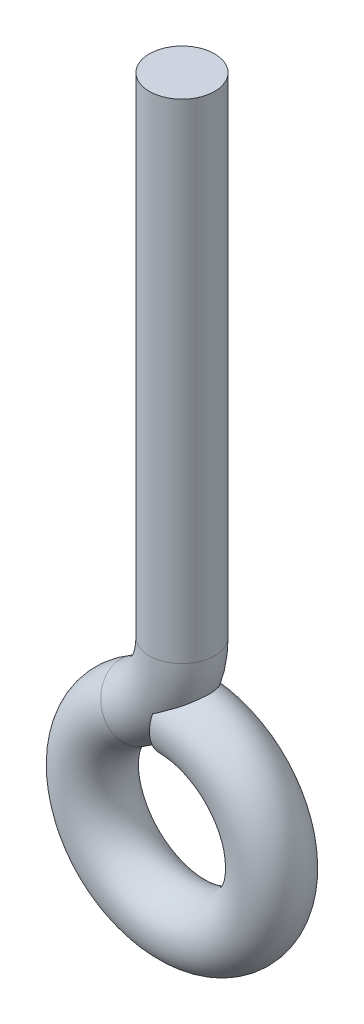
ISO-10303-21;
HEADER;
FILE_DESCRIPTION(('STEP AP214'),'2;1');
FILE_NAME('part.step','',(''),(''),'','','');
FILE_SCHEMA(('AUTOMOTIVE_DESIGN { 1 0 10303 214 1 1 1 1 }'));
ENDSEC;
DATA;
#1=APPLICATION_CONTEXT('core data for automotive mechanical design processes');
#2=APPLICATION_PROTOCOL_DEFINITION('international standard','automotive_design',2000,#1);
#3=PRODUCT_CONTEXT('',#1,'mechanical');
#4=PRODUCT('Part','Part','',(#3));
#5=PRODUCT_RELATED_PRODUCT_CATEGORY('part','',(#4));
#6=PRODUCT_DEFINITION_FORMATION('','',#4);
#7=PRODUCT_DEFINITION_CONTEXT('part definition',#1,'design');
#8=PRODUCT_DEFINITION('design','',#6,#7);
#9=PRODUCT_DEFINITION_SHAPE('','',#8);
#10=(LENGTH_UNIT() NAMED_UNIT(*) SI_UNIT(.MILLI.,.METRE.));
#11=(NAMED_UNIT(*) PLANE_ANGLE_UNIT() SI_UNIT($,.RADIAN.));
#12=(NAMED_UNIT(*) SI_UNIT($,.STERADIAN.) SOLID_ANGLE_UNIT());
#13=UNCERTAINTY_MEASURE_WITH_UNIT(LENGTH_MEASURE(1.E-05),#10,'distance_accuracy_value','');
#14=(GEOMETRIC_REPRESENTATION_CONTEXT(3) GLOBAL_UNCERTAINTY_ASSIGNED_CONTEXT((#13)) GLOBAL_UNIT_ASSIGNED_CONTEXT((#10,
#11,#12)) REPRESENTATION_CONTEXT('',''));
#15=CARTESIAN_POINT('',(0.,0.,0.));
#16=DIRECTION('',(0.,0.,1.));
#17=DIRECTION('',(1.,0.,0.));
#18=AXIS2_PLACEMENT_3D('',#15,#16,#17);
#19=CARTESIAN_POINT('',(0.,0.,0.));
#20=DIRECTION('',(0.,0.,1.));
#21=DIRECTION('',(1.,0.,0.));
#22=AXIS2_PLACEMENT_3D('',#19,#20,#21);
#23=TOROIDAL_SURFACE('',#22,5.5,2.);
#24=CARTESIAN_POINT('',(-2.75,4.76313972081441,0.));
#25=DIRECTION('',(0.866025403784439,0.5,0.));
#26=DIRECTION('',(0.,0.,1.));
#27=AXIS2_PLACEMENT_3D('',#24,#25,#26);
#28=CIRCLE('',#27,2.);
#29=CARTESIAN_POINT('',(-3.75,6.49519052838329,0.));
#30=VERTEX_POINT('',#29);
#31=EDGE_CURVE('E39',#30,#30,#28,.T.);
#32=CARTESIAN_POINT('',(0.,5.5,0.));
#33=DIRECTION('',(1.,0.,0.));
#34=DIRECTION('',(0.,0.,1.));
#35=AXIS2_PLACEMENT_3D('',#32,#33,#34);
#36=CIRCLE('',#35,2.);
#37=CARTESIAN_POINT('',(-1.06624432911396E-13,7.5,0.));
#38=VERTEX_POINT('',#37);
#39=EDGE_CURVE('E10',#38,#38,#36,.T.);
#40=CARTESIAN_POINT('',(0.,0.,0.));
#41=DIRECTION('',(0.,0.,1.));
#42=DIRECTION('',(1.,0.,0.));
#43=AXIS2_PLACEMENT_3D('',#40,#41,#42);
#44=CIRCLE('',#43,7.5);
#45=EDGE_CURVE('',#30,#38,#44,.T.);
#46=ORIENTED_EDGE('',*,*,#31,.F.);
#47=ORIENTED_EDGE('',*,*,#39,.T.);
#48=ORIENTED_EDGE('',*,*,#45,.T.);
#49=ORIENTED_EDGE('',*,*,#45,.F.);
#50=EDGE_LOOP('',(#46,#48,#47,#49));
#51=FACE_BOUND('',#50,.T.);
#52=ADVANCED_FACE('F33',(#51),#23,.T.);
#53=CARTESIAN_POINT('',(-5.5,9.52627944162882,0.));
#54=DIRECTION('',(0.,0.,-1.));
#55=DIRECTION('',(-1.,0.,0.));
#56=AXIS2_PLACEMENT_3D('',#53,#54,#55);
#57=TOROIDAL_SURFACE('',#56,5.5,2.);
#58=CARTESIAN_POINT('',(0.,9.52627944162882,0.));
#59=DIRECTION('',(0.,1.,0.));
#60=DIRECTION('',(0.,0.,1.));
#61=AXIS2_PLACEMENT_3D('',#58,#59,#60);
#62=CIRCLE('',#61,2.);
#63=CARTESIAN_POINT('',(0.,9.52627944162882,2.));
#64=VERTEX_POINT('',#63);
#65=EDGE_CURVE('E43',#64,#64,#62,.T.);
#66=ORIENTED_EDGE('',*,*,#65,.F.);
#67=EDGE_LOOP('',(#66));
#68=FACE_BOUND('',#67,.T.);
#69=ORIENTED_EDGE('',*,*,#31,.T.);
#70=EDGE_LOOP('',(#69));
#71=FACE_BOUND('',#70,.T.);
#72=ADVANCED_FACE('F58',(#68,#71),#57,.T.);
#73=CARTESIAN_POINT('',(0.,9.52627944162882,0.));
#74=DIRECTION('',(0.,1.,0.));
#75=DIRECTION('',(0.,0.,1.));
#76=AXIS2_PLACEMENT_3D('',#73,#74,#75);
#77=CYLINDRICAL_SURFACE('',#76,2.);
#78=ORIENTED_EDGE('',*,*,#65,.T.);
#79=EDGE_LOOP('',(#78));
#80=FACE_BOUND('',#79,.T.);
#81=CARTESIAN_POINT('',(0.,39.5262794416288,0.));
#82=DIRECTION('',(0.,1.,0.));
#83=DIRECTION('',(0.,0.,1.));
#84=AXIS2_PLACEMENT_3D('',#81,#82,#83);
#85=CIRCLE('',#84,2.);
#86=CARTESIAN_POINT('',(0.,39.5262794416288,2.));
#87=VERTEX_POINT('',#86);
#88=EDGE_CURVE('E47',#87,#87,#85,.T.);
#89=ORIENTED_EDGE('',*,*,#88,.F.);
#90=EDGE_LOOP('',(#89));
#91=FACE_BOUND('',#90,.T.);
#92=ADVANCED_FACE('F55',(#80,#91),#77,.T.);
#93=CARTESIAN_POINT('',(0.,5.5,0.));
#94=DIRECTION('',(1.,0.,0.));
#95=DIRECTION('',(0.,0.,1.));
#96=AXIS2_PLACEMENT_3D('',#93,#94,#95);
#97=PLANE('',#96);
#98=ORIENTED_EDGE('',*,*,#39,.F.);
#99=EDGE_LOOP('',(#98));
#100=FACE_BOUND('',#99,.T.);
#101=ADVANCED_FACE('F57',(#100),#97,.F.);
#102=CARTESIAN_POINT('',(0.,39.5262794416288,0.));
#103=DIRECTION('',(0.,1.,0.));
#104=DIRECTION('',(0.,0.,1.));
#105=AXIS2_PLACEMENT_3D('',#102,#103,#104);
#106=PLANE('',#105);
#107=ORIENTED_EDGE('',*,*,#88,.T.);
#108=EDGE_LOOP('',(#107));
#109=FACE_BOUND('',#108,.T.);
#110=ADVANCED_FACE('F53',(#109),#106,.T.);
#111=CLOSED_SHELL('',(#52,#72,#92,#101,#110));
#112=MANIFOLD_SOLID_BREP('B2',#111);
#113=ADVANCED_BREP_SHAPE_REPRESENTATION('',(#18,#112),#14);
#114=SHAPE_DEFINITION_REPRESENTATION(#9,#113);
ENDSEC;
END-ISO-10303-21;
